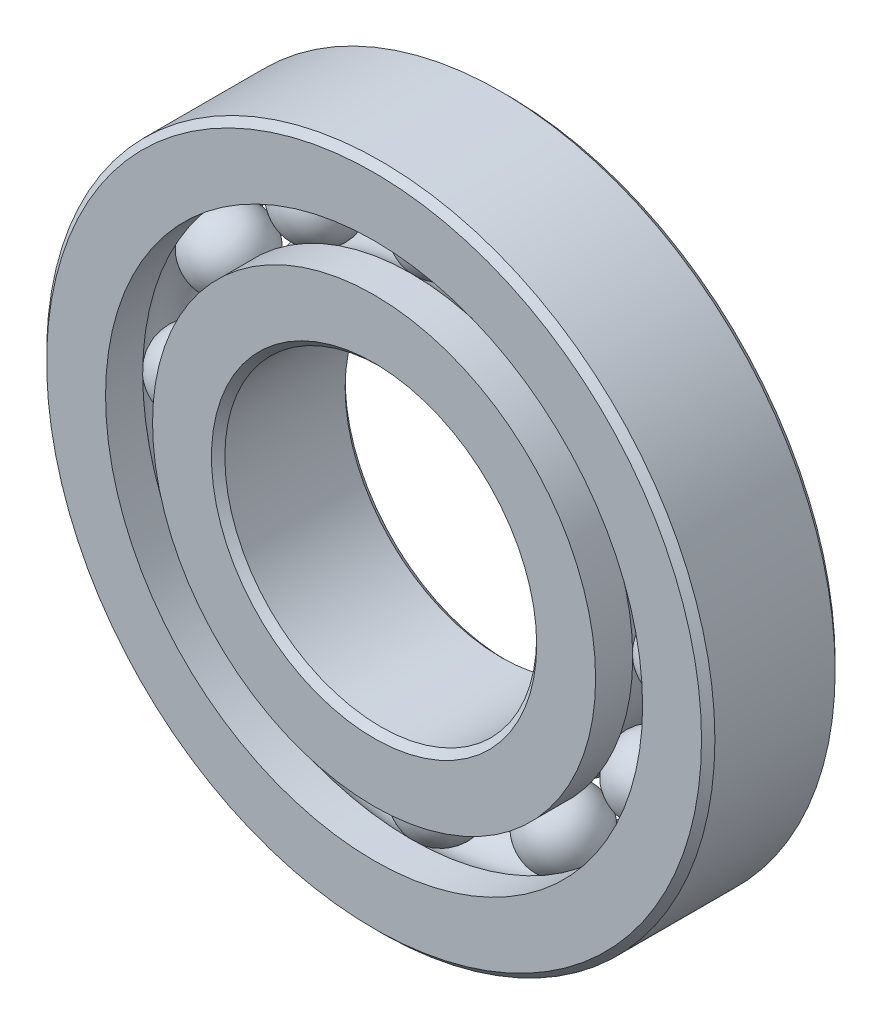
ISO-10303-21;
HEADER;
FILE_DESCRIPTION(('STEP AP214'),'2;1');
FILE_NAME('part.step','',(''),(''),'','','');
FILE_SCHEMA(('AUTOMOTIVE_DESIGN { 1 0 10303 214 1 1 1 1 }'));
ENDSEC;
DATA;
#1=APPLICATION_CONTEXT('core data for automotive mechanical design processes');
#2=APPLICATION_PROTOCOL_DEFINITION('international standard','automotive_design',2000,#1);
#3=PRODUCT_CONTEXT('',#1,'mechanical');
#4=PRODUCT('Part','Part','',(#3));
#5=PRODUCT_RELATED_PRODUCT_CATEGORY('part','',(#4));
#6=PRODUCT_DEFINITION_FORMATION('','',#4);
#7=PRODUCT_DEFINITION_CONTEXT('part definition',#1,'design');
#8=PRODUCT_DEFINITION('design','',#6,#7);
#9=PRODUCT_DEFINITION_SHAPE('','',#8);
#10=(LENGTH_UNIT() NAMED_UNIT(*) SI_UNIT(.MILLI.,.METRE.));
#11=(NAMED_UNIT(*) PLANE_ANGLE_UNIT() SI_UNIT($,.RADIAN.));
#12=(NAMED_UNIT(*) SI_UNIT($,.STERADIAN.) SOLID_ANGLE_UNIT());
#13=UNCERTAINTY_MEASURE_WITH_UNIT(LENGTH_MEASURE(1.E-05),#10,'distance_accuracy_value','');
#14=(GEOMETRIC_REPRESENTATION_CONTEXT(3) GLOBAL_UNCERTAINTY_ASSIGNED_CONTEXT((#13)) GLOBAL_UNIT_ASSIGNED_CONTEXT((#10,
#11,#12)) REPRESENTATION_CONTEXT('',''));
#15=CARTESIAN_POINT('',(0.,0.,0.));
#16=DIRECTION('',(0.,0.,1.));
#17=DIRECTION('',(1.,0.,0.));
#18=AXIS2_PLACEMENT_3D('',#15,#16,#17);
#19=CARTESIAN_POINT('',(-8.73124999999981,15.1229686135859,0.));
#20=DIRECTION('',(0.,0.,1.));
#21=DIRECTION('',(-0.499999999999989,0.866025403784445,0.));
#22=AXIS2_PLACEMENT_3D('',#19,#20,#21);
#23=SPHERICAL_SURFACE('',#22,2.69907067776696);
#24=CARTESIAN_POINT('',(-8.73124999999981,15.1229686135859,2.69907067776696));
#25=VERTEX_POINT('',#24);
#26=VERTEX_LOOP('',#25);
#27=FACE_BOUND('',#26,.T.);
#28=ADVANCED_FACE('F39',(#27),#23,.T.);
#29=CLOSED_SHELL('',(#28));
#30=MANIFOLD_SOLID_BREP('B2',#29);
#31=CARTESIAN_POINT('',(-15.1229686135857,8.73125000000018,0.));
#32=DIRECTION('',(0.,0.,1.));
#33=DIRECTION('',(-0.866025403784433,0.50000000000001,0.));
#34=AXIS2_PLACEMENT_3D('',#31,#32,#33);
#35=SPHERICAL_SURFACE('',#34,2.69907067776696);
#36=CARTESIAN_POINT('',(-15.1229686135857,8.73125000000018,2.69907067776696));
#37=VERTEX_POINT('',#36);
#38=VERTEX_LOOP('',#37);
#39=FACE_BOUND('',#38,.T.);
#40=ADVANCED_FACE('F59',(#39),#35,.T.);
#41=CLOSED_SHELL('',(#40));
#42=MANIFOLD_SOLID_BREP('B6',#41);
#43=CARTESIAN_POINT('',(-17.4625,1.82909978638645E-13,0.));
#44=DIRECTION('',(0.,0.,1.));
#45=DIRECTION('',(-1.,0.,0.));
#46=AXIS2_PLACEMENT_3D('',#43,#44,#45);
#47=SPHERICAL_SURFACE('',#46,2.69907067776696);
#48=CARTESIAN_POINT('',(-17.4625,1.82909978638645E-13,2.69907067776696));
#49=VERTEX_POINT('',#48);
#50=VERTEX_LOOP('',#49);
#51=FACE_BOUND('',#50,.T.);
#52=ADVANCED_FACE('F79',(#51),#47,.T.);
#53=CLOSED_SHELL('',(#52));
#54=MANIFOLD_SOLID_BREP('B35',#53);
#55=CARTESIAN_POINT('',(-15.1229686135858,-8.73124999999986,0.));
#56=DIRECTION('',(0.,0.,1.));
#57=DIRECTION('',(-0.866025403784443,-0.499999999999992,0.));
#58=AXIS2_PLACEMENT_3D('',#55,#56,#57);
#59=SPHERICAL_SURFACE('',#58,2.69907067776696);
#60=CARTESIAN_POINT('',(-15.1229686135858,-8.73124999999986,2.69907067776696));
#61=VERTEX_POINT('',#60);
#62=VERTEX_LOOP('',#61);
#63=FACE_BOUND('',#62,.T.);
#64=ADVANCED_FACE('F99',(#63),#59,.T.);
#65=CLOSED_SHELL('',(#64));
#66=MANIFOLD_SOLID_BREP('B55',#65);
#67=CARTESIAN_POINT('',(-8.73125000000012,-15.1229686135857,0.));
#68=DIRECTION('',(0.,0.,1.));
#69=DIRECTION('',(-0.500000000000007,-0.866025403784435,0.));
#70=AXIS2_PLACEMENT_3D('',#67,#68,#69);
#71=SPHERICAL_SURFACE('',#70,2.69907067776696);
#72=CARTESIAN_POINT('',(-8.73125000000012,-15.1229686135857,2.69907067776696));
#73=VERTEX_POINT('',#72);
#74=VERTEX_LOOP('',#73);
#75=FACE_BOUND('',#74,.T.);
#76=ADVANCED_FACE('F119',(#75),#71,.T.);
#77=CLOSED_SHELL('',(#76));
#78=MANIFOLD_SOLID_BREP('B75',#77);
#79=CARTESIAN_POINT('',(-1.21939985759096E-13,-17.4625,0.));
#80=DIRECTION('',(0.,0.,1.));
#81=DIRECTION('',(0.,-1.,0.));
#82=AXIS2_PLACEMENT_3D('',#79,#80,#81);
#83=SPHERICAL_SURFACE('',#82,2.69907067776696);
#84=CARTESIAN_POINT('',(-1.21939985759096E-13,-17.4625,2.69907067776696));
#85=VERTEX_POINT('',#84);
#86=VERTEX_LOOP('',#85);
#87=FACE_BOUND('',#86,.T.);
#88=ADVANCED_FACE('F139',(#87),#83,.T.);
#89=CLOSED_SHELL('',(#88));
#90=MANIFOLD_SOLID_BREP('B95',#89);
#91=CARTESIAN_POINT('',(8.73124999999991,-15.1229686135858,0.));
#92=DIRECTION('',(0.,0.,1.));
#93=DIRECTION('',(0.499999999999995,-0.866025403784442,0.));
#94=AXIS2_PLACEMENT_3D('',#91,#92,#93);
#95=SPHERICAL_SURFACE('',#94,2.69907067776696);
#96=CARTESIAN_POINT('',(8.73124999999991,-15.1229686135858,2.69907067776696));
#97=VERTEX_POINT('',#96);
#98=VERTEX_LOOP('',#97);
#99=FACE_BOUND('',#98,.T.);
#100=ADVANCED_FACE('F159',(#99),#95,.T.);
#101=CLOSED_SHELL('',(#100));
#102=MANIFOLD_SOLID_BREP('B115',#101);
#103=CARTESIAN_POINT('',(15.1229686135857,-8.73125000000007,0.));
#104=DIRECTION('',(0.,0.,1.));
#105=DIRECTION('',(0.866025403784436,-0.500000000000004,0.));
#106=AXIS2_PLACEMENT_3D('',#103,#104,#105);
#107=SPHERICAL_SURFACE('',#106,2.69907067776696);
#108=CARTESIAN_POINT('',(15.1229686135857,-8.73125000000007,2.69907067776696));
#109=VERTEX_POINT('',#108);
#110=VERTEX_LOOP('',#109);
#111=FACE_BOUND('',#110,.T.);
#112=ADVANCED_FACE('F179',(#111),#107,.T.);
#113=CLOSED_SHELL('',(#112));
#114=MANIFOLD_SOLID_BREP('B135',#113);
#115=CARTESIAN_POINT('',(17.4625,0.,0.));
#116=DIRECTION('',(0.,0.,1.));
#117=DIRECTION('',(1.,0.,0.));
#118=AXIS2_PLACEMENT_3D('',#115,#116,#117);
#119=SPHERICAL_SURFACE('',#118,2.69907067776696);
#120=CARTESIAN_POINT('',(17.4625,0.,2.69907067776696));
#121=VERTEX_POINT('',#120);
#122=VERTEX_LOOP('',#121);
#123=FACE_BOUND('',#122,.T.);
#124=ADVANCED_FACE('F199',(#123),#119,.T.);
#125=CLOSED_SHELL('',(#124));
#126=MANIFOLD_SOLID_BREP('B155',#125);
#127=CARTESIAN_POINT('',(15.1229686135858,8.73124999999997,0.));
#128=DIRECTION('',(0.,0.,1.));
#129=DIRECTION('',(0.86602540378444,0.499999999999998,0.));
#130=AXIS2_PLACEMENT_3D('',#127,#128,#129);
#131=SPHERICAL_SURFACE('',#130,2.69907067776696);
#132=CARTESIAN_POINT('',(15.1229686135858,8.73124999999997,2.69907067776696));
#133=VERTEX_POINT('',#132);
#134=VERTEX_LOOP('',#133);
#135=FACE_BOUND('',#134,.T.);
#136=ADVANCED_FACE('F219',(#135),#131,.T.);
#137=CLOSED_SHELL('',(#136));
#138=MANIFOLD_SOLID_BREP('B175',#137);
#139=CARTESIAN_POINT('',(8.73125000000002,15.1229686135857,0.));
#140=DIRECTION('',(0.,0.,1.));
#141=DIRECTION('',(0.500000000000001,0.866025403784438,0.));
#142=AXIS2_PLACEMENT_3D('',#139,#140,#141);
#143=SPHERICAL_SURFACE('',#142,2.69907067776696);
#144=CARTESIAN_POINT('',(8.73125000000002,15.1229686135857,2.69907067776696));
#145=VERTEX_POINT('',#144);
#146=VERTEX_LOOP('',#145);
#147=FACE_BOUND('',#146,.T.);
#148=ADVANCED_FACE('F239',(#147),#143,.T.);
#149=CLOSED_SHELL('',(#148));
#150=MANIFOLD_SOLID_BREP('B195',#149);
#151=CARTESIAN_POINT('',(0.,17.4625,0.));
#152=DIRECTION('',(0.,0.,1.));
#153=DIRECTION('',(0.,1.,0.));
#154=AXIS2_PLACEMENT_3D('',#151,#152,#153);
#155=SPHERICAL_SURFACE('',#154,2.69907067776696);
#156=CARTESIAN_POINT('',(0.,17.4625,2.69907067776696));
#157=VERTEX_POINT('',#156);
#158=VERTEX_LOOP('',#157);
#159=FACE_BOUND('',#158,.T.);
#160=ADVANCED_FACE('F261',(#159),#155,.T.);
#161=CLOSED_SHELL('',(#160));
#162=MANIFOLD_SOLID_BREP('B215',#161);
#163=CARTESIAN_POINT('',(0.,15.7877747252747,4.7625));
#164=DIRECTION('',(0.,0.,-1.));
#165=DIRECTION('',(-1.,0.,0.));
#166=AXIS2_PLACEMENT_3D('',#163,#164,#165);
#167=PLANE('',#166);
#168=CARTESIAN_POINT('',(0.,0.,4.7625));
#169=DIRECTION('',(0.,0.,1.));
#170=DIRECTION('',(1.,0.,0.));
#171=AXIS2_PLACEMENT_3D('',#168,#169,#170);
#172=CIRCLE('',#171,11.58875);
#173=CARTESIAN_POINT('',(11.58875,0.,4.7625));
#174=VERTEX_POINT('',#173);
#175=EDGE_CURVE('E308',#174,#174,#172,.T.);
#176=ORIENTED_EDGE('',*,*,#175,.F.);
#177=EDGE_LOOP('',(#176));
#178=FACE_BOUND('',#177,.T.);
#179=CARTESIAN_POINT('',(0.,0.,4.7625));
#180=DIRECTION('',(0.,0.,1.));
#181=DIRECTION('',(1.,0.,0.));
#182=AXIS2_PLACEMENT_3D('',#179,#180,#181);
#183=CIRCLE('',#182,15.7877747252747);
#184=CARTESIAN_POINT('',(15.7877747252747,0.,4.7625));
#185=VERTEX_POINT('',#184);
#186=EDGE_CURVE('E260',#185,#185,#183,.T.);
#187=ORIENTED_EDGE('',*,*,#186,.T.);
#188=EDGE_LOOP('',(#187));
#189=FACE_BOUND('',#188,.T.);
#190=ADVANCED_FACE('F280',(#178,#189),#167,.F.);
#191=CARTESIAN_POINT('',(0.,0.,4.7625));
#192=DIRECTION('',(0.,0.,1.));
#193=DIRECTION('',(1.,0.,0.));
#194=AXIS2_PLACEMENT_3D('',#191,#192,#193);
#195=CYLINDRICAL_SURFACE('',#194,15.7877747252747);
#196=ORIENTED_EDGE('',*,*,#186,.F.);
#197=EDGE_LOOP('',(#196));
#198=FACE_BOUND('',#197,.T.);
#199=CARTESIAN_POINT('',(0.,0.,2.11666666666667));
#200=DIRECTION('',(0.,0.,1.));
#201=DIRECTION('',(1.,0.,0.));
#202=AXIS2_PLACEMENT_3D('',#199,#200,#201);
#203=CIRCLE('',#202,15.7877747252747);
#204=CARTESIAN_POINT('',(15.7877747252747,0.,2.11666666666667));
#205=VERTEX_POINT('',#204);
#206=EDGE_CURVE('E286',#205,#205,#203,.T.);
#207=ORIENTED_EDGE('',*,*,#206,.T.);
#208=EDGE_LOOP('',(#207));
#209=FACE_BOUND('',#208,.T.);
#210=ADVANCED_FACE('F315',(#198,#209),#195,.T.);
#211=CARTESIAN_POINT('',(0.,0.,0.));
#212=DIRECTION('',(0.,0.,1.));
#213=DIRECTION('',(1.,0.,0.));
#214=AXIS2_PLACEMENT_3D('',#211,#212,#213);
#215=TOROIDAL_SURFACE('',#214,17.4625,2.69907067776696);
#216=ORIENTED_EDGE('',*,*,#206,.F.);
#217=EDGE_LOOP('',(#216));
#218=FACE_BOUND('',#217,.T.);
#219=CARTESIAN_POINT('',(0.,0.,-2.11666666666667));
#220=DIRECTION('',(0.,0.,1.));
#221=DIRECTION('',(1.,0.,0.));
#222=AXIS2_PLACEMENT_3D('',#219,#220,#221);
#223=CIRCLE('',#222,15.7877747252747);
#224=CARTESIAN_POINT('',(15.7877747252747,0.,-2.11666666666667));
#225=VERTEX_POINT('',#224);
#226=EDGE_CURVE('E290',#225,#225,#223,.T.);
#227=ORIENTED_EDGE('',*,*,#226,.T.);
#228=EDGE_LOOP('',(#227));
#229=FACE_BOUND('',#228,.T.);
#230=ADVANCED_FACE('F319',(#218,#229),#215,.F.);
#231=CARTESIAN_POINT('',(0.,0.,4.7625));
#232=DIRECTION('',(0.,0.,1.));
#233=DIRECTION('',(1.,0.,0.));
#234=AXIS2_PLACEMENT_3D('',#231,#232,#233);
#235=CYLINDRICAL_SURFACE('',#234,15.7877747252747);
#236=ORIENTED_EDGE('',*,*,#226,.F.);
#237=EDGE_LOOP('',(#236));
#238=FACE_BOUND('',#237,.T.);
#239=CARTESIAN_POINT('',(0.,0.,-4.7625));
#240=DIRECTION('',(0.,0.,1.));
#241=DIRECTION('',(1.,0.,0.));
#242=AXIS2_PLACEMENT_3D('',#239,#240,#241);
#243=CIRCLE('',#242,15.7877747252747);
#244=CARTESIAN_POINT('',(15.7877747252747,0.,-4.7625));
#245=VERTEX_POINT('',#244);
#246=EDGE_CURVE('E294',#245,#245,#243,.T.);
#247=ORIENTED_EDGE('',*,*,#246,.T.);
#248=EDGE_LOOP('',(#247));
#249=FACE_BOUND('',#248,.T.);
#250=ADVANCED_FACE('F324',(#238,#249),#235,.T.);
#251=CARTESIAN_POINT('',(0.,11.58875,-4.7625));
#252=DIRECTION('',(0.,0.,1.));
#253=DIRECTION('',(1.,0.,0.));
#254=AXIS2_PLACEMENT_3D('',#251,#252,#253);
#255=PLANE('',#254);
#256=ORIENTED_EDGE('',*,*,#246,.F.);
#257=EDGE_LOOP('',(#256));
#258=FACE_BOUND('',#257,.T.);
#259=CARTESIAN_POINT('',(0.,0.,-4.76250000000001));
#260=DIRECTION('',(0.,0.,1.));
#261=DIRECTION('',(1.,0.,0.));
#262=AXIS2_PLACEMENT_3D('',#259,#260,#261);
#263=CIRCLE('',#262,11.58875);
#264=CARTESIAN_POINT('',(11.58875,0.,-4.76250000000001));
#265=VERTEX_POINT('',#264);
#266=EDGE_CURVE('E299',#265,#265,#263,.T.);
#267=ORIENTED_EDGE('',*,*,#266,.T.);
#268=EDGE_LOOP('',(#267));
#269=FACE_BOUND('',#268,.T.);
#270=ADVANCED_FACE('F330',(#258,#269),#255,.F.);
#271=CARTESIAN_POINT('',(0.,0.,-4.28625));
#272=DIRECTION('',(0.,0.,-1.));
#273=DIRECTION('',(-1.,0.,0.));
#274=AXIS2_PLACEMENT_3D('',#271,#272,#273);
#275=CONICAL_SURFACE('',#274,11.1125,0.785398163397445);
#276=ORIENTED_EDGE('',*,*,#266,.F.);
#277=EDGE_LOOP('',(#276));
#278=FACE_BOUND('',#277,.T.);
#279=CARTESIAN_POINT('',(0.,0.,-4.28625));
#280=DIRECTION('',(0.,0.,1.));
#281=DIRECTION('',(1.,0.,0.));
#282=AXIS2_PLACEMENT_3D('',#279,#280,#281);
#283=CIRCLE('',#282,11.1125);
#284=CARTESIAN_POINT('',(11.1125,0.,-4.28625));
#285=VERTEX_POINT('',#284);
#286=EDGE_CURVE('E302',#285,#285,#283,.T.);
#287=ORIENTED_EDGE('',*,*,#286,.T.);
#288=EDGE_LOOP('',(#287));
#289=FACE_BOUND('',#288,.T.);
#290=ADVANCED_FACE('F334',(#278,#289),#275,.F.);
#291=CARTESIAN_POINT('',(0.,0.,4.7625));
#292=DIRECTION('',(0.,0.,1.));
#293=DIRECTION('',(1.,0.,0.));
#294=AXIS2_PLACEMENT_3D('',#291,#292,#293);
#295=CYLINDRICAL_SURFACE('',#294,11.1125);
#296=ORIENTED_EDGE('',*,*,#286,.F.);
#297=EDGE_LOOP('',(#296));
#298=FACE_BOUND('',#297,.T.);
#299=CARTESIAN_POINT('',(0.,0.,4.28625000000001));
#300=DIRECTION('',(0.,0.,1.));
#301=DIRECTION('',(1.,0.,0.));
#302=AXIS2_PLACEMENT_3D('',#299,#300,#301);
#303=CIRCLE('',#302,11.1125);
#304=CARTESIAN_POINT('',(11.1125,0.,4.28625000000001));
#305=VERTEX_POINT('',#304);
#306=EDGE_CURVE('E305',#305,#305,#303,.T.);
#307=ORIENTED_EDGE('',*,*,#306,.T.);
#308=EDGE_LOOP('',(#307));
#309=FACE_BOUND('',#308,.T.);
#310=ADVANCED_FACE('F338',(#298,#309),#295,.F.);
#311=CARTESIAN_POINT('',(0.,0.,4.7625));
#312=DIRECTION('',(0.,0.,1.));
#313=DIRECTION('',(1.,0.,0.));
#314=AXIS2_PLACEMENT_3D('',#311,#312,#313);
#315=CONICAL_SURFACE('',#314,11.58875,0.785398163397452);
#316=ORIENTED_EDGE('',*,*,#306,.F.);
#317=EDGE_LOOP('',(#316));
#318=FACE_BOUND('',#317,.T.);
#319=ORIENTED_EDGE('',*,*,#175,.T.);
#320=EDGE_LOOP('',(#319));
#321=FACE_BOUND('',#320,.T.);
#322=ADVANCED_FACE('F312',(#318,#321),#315,.F.);
#323=CLOSED_SHELL('',(#190,#210,#230,#250,#270,#290,#310,#322));
#324=MANIFOLD_SOLID_BREP('B235',#323);
#325=CARTESIAN_POINT('',(0.,0.,4.28625));
#326=DIRECTION('',(0.,0.,-1.));
#327=DIRECTION('',(-1.,0.,0.));
#328=AXIS2_PLACEMENT_3D('',#325,#326,#327);
#329=CONICAL_SURFACE('',#328,23.8125,0.785398163397446);
#330=CARTESIAN_POINT('',(0.,0.,4.7625));
#331=DIRECTION('',(0.,0.,1.));
#332=DIRECTION('',(1.,0.,0.));
#333=AXIS2_PLACEMENT_3D('',#330,#331,#332);
#334=CIRCLE('',#333,23.33625);
#335=CARTESIAN_POINT('',(23.33625,0.,4.7625));
#336=VERTEX_POINT('',#335);
#337=EDGE_CURVE('E429',#336,#336,#334,.T.);
#338=ORIENTED_EDGE('',*,*,#337,.F.);
#339=EDGE_LOOP('',(#338));
#340=FACE_BOUND('',#339,.T.);
#341=CARTESIAN_POINT('',(0.,0.,4.28625));
#342=DIRECTION('',(0.,0.,1.));
#343=DIRECTION('',(1.,0.,0.));
#344=AXIS2_PLACEMENT_3D('',#341,#342,#343);
#345=CIRCLE('',#344,23.8125);
#346=CARTESIAN_POINT('',(23.8125,0.,4.28625));
#347=VERTEX_POINT('',#346);
#348=EDGE_CURVE('E279',#347,#347,#345,.T.);
#349=ORIENTED_EDGE('',*,*,#348,.T.);
#350=EDGE_LOOP('',(#349));
#351=FACE_BOUND('',#350,.T.);
#352=ADVANCED_FACE('F401',(#340,#351),#329,.T.);
#353=CARTESIAN_POINT('',(0.,0.,4.7625));
#354=DIRECTION('',(0.,0.,1.));
#355=DIRECTION('',(1.,0.,0.));
#356=AXIS2_PLACEMENT_3D('',#353,#354,#355);
#357=CYLINDRICAL_SURFACE('',#356,23.8125);
#358=ORIENTED_EDGE('',*,*,#348,.F.);
#359=EDGE_LOOP('',(#358));
#360=FACE_BOUND('',#359,.T.);
#361=CARTESIAN_POINT('',(0.,0.,-4.28625));
#362=DIRECTION('',(0.,0.,1.));
#363=DIRECTION('',(1.,0.,0.));
#364=AXIS2_PLACEMENT_3D('',#361,#362,#363);
#365=CIRCLE('',#364,23.8125);
#366=CARTESIAN_POINT('',(23.8125,0.,-4.28625));
#367=VERTEX_POINT('',#366);
#368=EDGE_CURVE('E407',#367,#367,#365,.T.);
#369=ORIENTED_EDGE('',*,*,#368,.T.);
#370=EDGE_LOOP('',(#369));
#371=FACE_BOUND('',#370,.T.);
#372=ADVANCED_FACE('F436',(#360,#371),#357,.T.);
#373=CARTESIAN_POINT('',(0.,0.,-4.7625));
#374=DIRECTION('',(0.,0.,1.));
#375=DIRECTION('',(1.,0.,0.));
#376=AXIS2_PLACEMENT_3D('',#373,#374,#375);
#377=CONICAL_SURFACE('',#376,23.33625,0.785398163397447);
#378=ORIENTED_EDGE('',*,*,#368,.F.);
#379=EDGE_LOOP('',(#378));
#380=FACE_BOUND('',#379,.T.);
#381=CARTESIAN_POINT('',(0.,0.,-4.7625));
#382=DIRECTION('',(0.,0.,1.));
#383=DIRECTION('',(1.,0.,0.));
#384=AXIS2_PLACEMENT_3D('',#381,#382,#383);
#385=CIRCLE('',#384,23.33625);
#386=CARTESIAN_POINT('',(23.33625,0.,-4.7625));
#387=VERTEX_POINT('',#386);
#388=EDGE_CURVE('E411',#387,#387,#385,.T.);
#389=ORIENTED_EDGE('',*,*,#388,.T.);
#390=EDGE_LOOP('',(#389));
#391=FACE_BOUND('',#390,.T.);
#392=ADVANCED_FACE('F440',(#380,#391),#377,.T.);
#393=CARTESIAN_POINT('',(0.,23.33625,-4.7625));
#394=DIRECTION('',(0.,0.,1.));
#395=DIRECTION('',(1.,0.,0.));
#396=AXIS2_PLACEMENT_3D('',#393,#394,#395);
#397=PLANE('',#396);
#398=ORIENTED_EDGE('',*,*,#388,.F.);
#399=EDGE_LOOP('',(#398));
#400=FACE_BOUND('',#399,.T.);
#401=CARTESIAN_POINT('',(0.,0.,-4.76250000000001));
#402=DIRECTION('',(0.,0.,1.));
#403=DIRECTION('',(1.,0.,0.));
#404=AXIS2_PLACEMENT_3D('',#401,#402,#403);
#405=CIRCLE('',#404,19.1372252747253);
#406=CARTESIAN_POINT('',(19.1372252747253,0.,-4.76250000000001));
#407=VERTEX_POINT('',#406);
#408=EDGE_CURVE('E415',#407,#407,#405,.T.);
#409=ORIENTED_EDGE('',*,*,#408,.T.);
#410=EDGE_LOOP('',(#409));
#411=FACE_BOUND('',#410,.T.);
#412=ADVANCED_FACE('F445',(#400,#411),#397,.F.);
#413=CARTESIAN_POINT('',(0.,0.,4.7625));
#414=DIRECTION('',(0.,0.,1.));
#415=DIRECTION('',(1.,0.,0.));
#416=AXIS2_PLACEMENT_3D('',#413,#414,#415);
#417=CYLINDRICAL_SURFACE('',#416,19.1372252747253);
#418=ORIENTED_EDGE('',*,*,#408,.F.);
#419=EDGE_LOOP('',(#418));
#420=FACE_BOUND('',#419,.T.);
#421=CARTESIAN_POINT('',(0.,0.,-2.11666666666667));
#422=DIRECTION('',(0.,0.,1.));
#423=DIRECTION('',(1.,0.,0.));
#424=AXIS2_PLACEMENT_3D('',#421,#422,#423);
#425=CIRCLE('',#424,19.1372252747253);
#426=CARTESIAN_POINT('',(19.1372252747253,0.,-2.11666666666667));
#427=VERTEX_POINT('',#426);
#428=EDGE_CURVE('E420',#427,#427,#425,.T.);
#429=ORIENTED_EDGE('',*,*,#428,.T.);
#430=EDGE_LOOP('',(#429));
#431=FACE_BOUND('',#430,.T.);
#432=ADVANCED_FACE('F451',(#420,#431),#417,.F.);
#433=CARTESIAN_POINT('',(0.,0.,0.));
#434=DIRECTION('',(0.,0.,1.));
#435=DIRECTION('',(1.,0.,0.));
#436=AXIS2_PLACEMENT_3D('',#433,#434,#435);
#437=TOROIDAL_SURFACE('',#436,17.4625,2.69907067776696);
#438=ORIENTED_EDGE('',*,*,#428,.F.);
#439=EDGE_LOOP('',(#438));
#440=FACE_BOUND('',#439,.T.);
#441=CARTESIAN_POINT('',(0.,0.,2.11666666666667));
#442=DIRECTION('',(0.,0.,1.));
#443=DIRECTION('',(1.,0.,0.));
#444=AXIS2_PLACEMENT_3D('',#441,#442,#443);
#445=CIRCLE('',#444,19.1372252747253);
#446=CARTESIAN_POINT('',(19.1372252747253,0.,2.11666666666667));
#447=VERTEX_POINT('',#446);
#448=EDGE_CURVE('E423',#447,#447,#445,.T.);
#449=ORIENTED_EDGE('',*,*,#448,.T.);
#450=EDGE_LOOP('',(#449));
#451=FACE_BOUND('',#450,.T.);
#452=ADVANCED_FACE('F455',(#440,#451),#437,.F.);
#453=CARTESIAN_POINT('',(0.,0.,4.7625));
#454=DIRECTION('',(0.,0.,1.));
#455=DIRECTION('',(1.,0.,0.));
#456=AXIS2_PLACEMENT_3D('',#453,#454,#455);
#457=CYLINDRICAL_SURFACE('',#456,19.1372252747253);
#458=ORIENTED_EDGE('',*,*,#448,.F.);
#459=EDGE_LOOP('',(#458));
#460=FACE_BOUND('',#459,.T.);
#461=CARTESIAN_POINT('',(0.,0.,4.7625));
#462=DIRECTION('',(0.,0.,1.));
#463=DIRECTION('',(1.,0.,0.));
#464=AXIS2_PLACEMENT_3D('',#461,#462,#463);
#465=CIRCLE('',#464,19.1372252747253);
#466=CARTESIAN_POINT('',(19.1372252747253,0.,4.7625));
#467=VERTEX_POINT('',#466);
#468=EDGE_CURVE('E426',#467,#467,#465,.T.);
#469=ORIENTED_EDGE('',*,*,#468,.T.);
#470=EDGE_LOOP('',(#469));
#471=FACE_BOUND('',#470,.T.);
#472=ADVANCED_FACE('F459',(#460,#471),#457,.F.);
#473=CARTESIAN_POINT('',(0.,23.33625,4.7625));
#474=DIRECTION('',(0.,0.,-1.));
#475=DIRECTION('',(-1.,0.,0.));
#476=AXIS2_PLACEMENT_3D('',#473,#474,#475);
#477=PLANE('',#476);
#478=ORIENTED_EDGE('',*,*,#468,.F.);
#479=EDGE_LOOP('',(#478));
#480=FACE_BOUND('',#479,.T.);
#481=ORIENTED_EDGE('',*,*,#337,.T.);
#482=EDGE_LOOP('',(#481));
#483=FACE_BOUND('',#482,.T.);
#484=ADVANCED_FACE('F433',(#480,#483),#477,.F.);
#485=CLOSED_SHELL('',(#352,#372,#392,#412,#432,#452,#472,#484));
#486=MANIFOLD_SOLID_BREP('B255',#485);
#487=ADVANCED_BREP_SHAPE_REPRESENTATION('',(#18,#30,#42,#54,#66,#78,#90,#102,#114,#126,#138,
#150,#162,#324,#486),#14);
#488=SHAPE_DEFINITION_REPRESENTATION(#9,#487);
ENDSEC;
END-ISO-10303-21;
